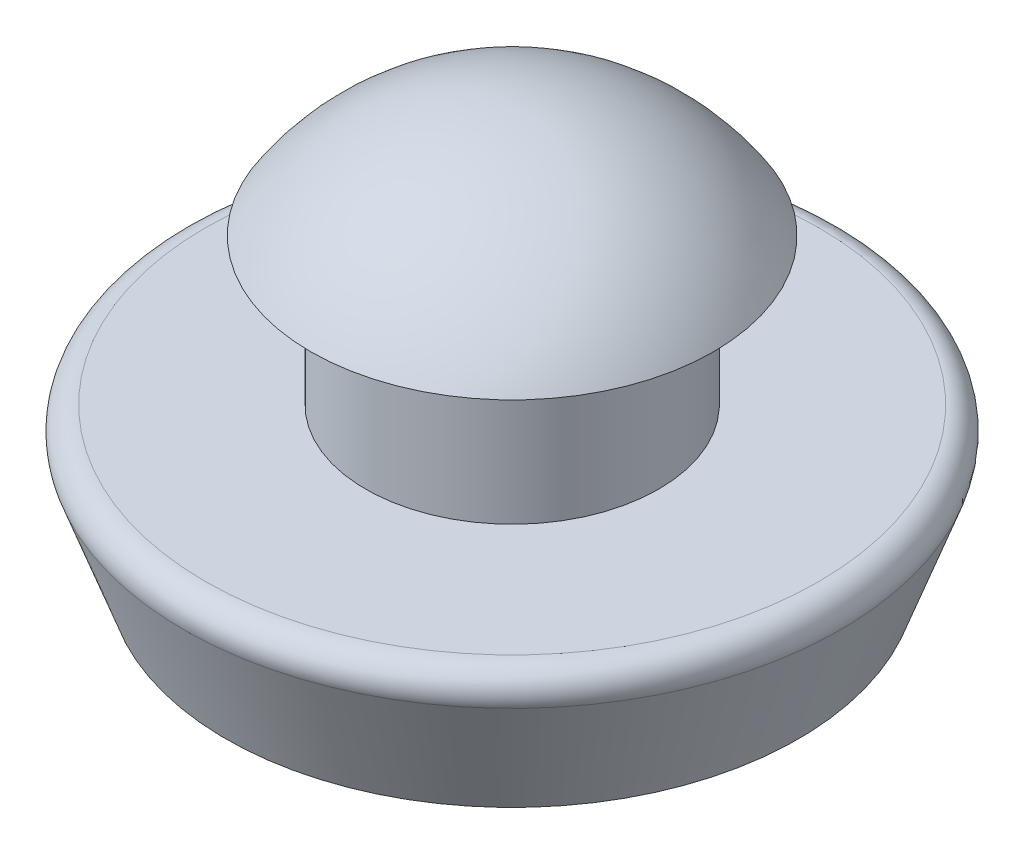
ISO-10303-21;
HEADER;
FILE_DESCRIPTION(('STEP AP214'),'2;1');
FILE_NAME('part.step','',(''),(''),'','','');
FILE_SCHEMA(('AUTOMOTIVE_DESIGN { 1 0 10303 214 1 1 1 1 }'));
ENDSEC;
DATA;
#1=APPLICATION_CONTEXT('core data for automotive mechanical design processes');
#2=APPLICATION_PROTOCOL_DEFINITION('international standard','automotive_design',2000,#1);
#3=PRODUCT_CONTEXT('',#1,'mechanical');
#4=PRODUCT('Part','Part','',(#3));
#5=PRODUCT_RELATED_PRODUCT_CATEGORY('part','',(#4));
#6=PRODUCT_DEFINITION_FORMATION('','',#4);
#7=PRODUCT_DEFINITION_CONTEXT('part definition',#1,'design');
#8=PRODUCT_DEFINITION('design','',#6,#7);
#9=PRODUCT_DEFINITION_SHAPE('','',#8);
#10=(LENGTH_UNIT() NAMED_UNIT(*) SI_UNIT(.MILLI.,.METRE.));
#11=(NAMED_UNIT(*) PLANE_ANGLE_UNIT() SI_UNIT($,.RADIAN.));
#12=(NAMED_UNIT(*) SI_UNIT($,.STERADIAN.) SOLID_ANGLE_UNIT());
#13=UNCERTAINTY_MEASURE_WITH_UNIT(LENGTH_MEASURE(1.E-05),#10,'distance_accuracy_value','');
#14=(GEOMETRIC_REPRESENTATION_CONTEXT(3) GLOBAL_UNCERTAINTY_ASSIGNED_CONTEXT((#13)) GLOBAL_UNIT_ASSIGNED_CONTEXT((#10,
#11,#12)) REPRESENTATION_CONTEXT('',''));
#15=CARTESIAN_POINT('',(0.,0.,0.));
#16=DIRECTION('',(0.,0.,1.));
#17=DIRECTION('',(1.,0.,0.));
#18=AXIS2_PLACEMENT_3D('',#15,#16,#17);
#19=CARTESIAN_POINT('',(0.,0.363802083333331,0.));
#20=DIRECTION('',(0.,1.,0.));
#21=DIRECTION('',(-1.,0.,0.));
#22=AXIS2_PLACEMENT_3D('',#19,#20,#21);
#23=SPHERICAL_SURFACE('',#22,5.19244791666667);
#24=CARTESIAN_POINT('',(0.,3.175,0.));
#25=DIRECTION('',(0.,1.,0.));
#26=DIRECTION('',(-1.,0.,0.));
#27=AXIS2_PLACEMENT_3D('',#24,#25,#26);
#28=CIRCLE('',#27,4.365625);
#29=CARTESIAN_POINT('',(-4.365625,3.175,0.));
#30=VERTEX_POINT('',#29);
#31=EDGE_CURVE('E54',#30,#30,#28,.T.);
#32=ORIENTED_EDGE('',*,*,#31,.T.);
#33=EDGE_LOOP('',(#32));
#34=FACE_BOUND('',#33,.T.);
#35=ADVANCED_FACE('F32',(#34),#23,.T.);
#36=CARTESIAN_POINT('',(0.,-3.175,0.));
#37=DIRECTION('',(0.,-1.,0.));
#38=DIRECTION('',(1.,0.,0.));
#39=AXIS2_PLACEMENT_3D('',#36,#37,#38);
#40=PLANE('',#39);
#41=CARTESIAN_POINT('',(0.,-3.175,0.));
#42=DIRECTION('',(0.,1.,0.));
#43=DIRECTION('',(-1.,0.,0.));
#44=AXIS2_PLACEMENT_3D('',#41,#42,#43);
#45=CIRCLE('',#44,6.20221850957588);
#46=CARTESIAN_POINT('',(-6.20221850957588,-3.175,0.));
#47=VERTEX_POINT('',#46);
#48=EDGE_CURVE('E10',#47,#47,#45,.T.);
#49=ORIENTED_EDGE('',*,*,#48,.F.);
#50=EDGE_LOOP('',(#49));
#51=FACE_BOUND('',#50,.T.);
#52=ADVANCED_FACE('F71',(#51),#40,.T.);
#53=CARTESIAN_POINT('',(0.,-0.671010071662831,0.));
#54=DIRECTION('',(0.,1.,0.));
#55=DIRECTION('',(-1.,0.,0.));
#56=AXIS2_PLACEMENT_3D('',#53,#54,#55);
#57=CONICAL_SURFACE('',#56,7.11359631039296,0.34906585039886);
#58=ORIENTED_EDGE('',*,*,#48,.T.);
#59=EDGE_LOOP('',(#58));
#60=FACE_BOUND('',#59,.T.);
#61=CARTESIAN_POINT('',(0.,-0.671010071662831,0.));
#62=DIRECTION('',(0.,1.,0.));
#63=DIRECTION('',(-1.,0.,0.));
#64=AXIS2_PLACEMENT_3D('',#61,#62,#63);
#65=CIRCLE('',#64,7.11359631039296);
#66=CARTESIAN_POINT('',(-7.11359631039296,-0.671010071662831,0.));
#67=VERTEX_POINT('',#66);
#68=EDGE_CURVE('E38',#67,#67,#65,.T.);
#69=ORIENTED_EDGE('',*,*,#68,.F.);
#70=EDGE_LOOP('',(#69));
#71=FACE_BOUND('',#70,.T.);
#72=ADVANCED_FACE('F75',(#60,#71),#57,.T.);
#73=CARTESIAN_POINT('',(0.,-0.499999999999999,0.));
#74=DIRECTION('',(0.,1.,0.));
#75=DIRECTION('',(-1.,0.,0.));
#76=AXIS2_PLACEMENT_3D('',#73,#74,#75);
#77=TOROIDAL_SURFACE('',#76,6.64375,0.5);
#78=ORIENTED_EDGE('',*,*,#68,.T.);
#79=EDGE_LOOP('',(#78));
#80=FACE_BOUND('',#79,.T.);
#81=CARTESIAN_POINT('',(0.,0.,0.));
#82=DIRECTION('',(0.,1.,0.));
#83=DIRECTION('',(-1.,0.,0.));
#84=AXIS2_PLACEMENT_3D('',#81,#82,#83);
#85=CIRCLE('',#84,6.64375);
#86=CARTESIAN_POINT('',(-6.64375,0.,0.));
#87=VERTEX_POINT('',#86);
#88=EDGE_CURVE('E42',#87,#87,#85,.T.);
#89=ORIENTED_EDGE('',*,*,#88,.F.);
#90=EDGE_LOOP('',(#89));
#91=FACE_BOUND('',#90,.T.);
#92=ADVANCED_FACE('F80',(#80,#91),#77,.T.);
#93=CARTESIAN_POINT('',(-6.64375,0.,0.));
#94=DIRECTION('',(0.,1.,0.));
#95=DIRECTION('',(-1.,0.,0.));
#96=AXIS2_PLACEMENT_3D('',#93,#94,#95);
#97=PLANE('',#96);
#98=ORIENTED_EDGE('',*,*,#88,.T.);
#99=EDGE_LOOP('',(#98));
#100=FACE_BOUND('',#99,.T.);
#101=CARTESIAN_POINT('',(0.,0.,0.));
#102=DIRECTION('',(0.,1.,0.));
#103=DIRECTION('',(-1.,0.,0.));
#104=AXIS2_PLACEMENT_3D('',#101,#102,#103);
#105=CIRCLE('',#104,3.175);
#106=CARTESIAN_POINT('',(-3.175,0.,0.));
#107=VERTEX_POINT('',#106);
#108=EDGE_CURVE('E46',#107,#107,#105,.T.);
#109=ORIENTED_EDGE('',*,*,#108,.F.);
#110=EDGE_LOOP('',(#109));
#111=FACE_BOUND('',#110,.T.);
#112=ADVANCED_FACE('F67',(#100,#111),#97,.T.);
#113=CARTESIAN_POINT('',(0.,5.55625,0.));
#114=DIRECTION('',(0.,1.,0.));
#115=DIRECTION('',(-1.,0.,0.));
#116=AXIS2_PLACEMENT_3D('',#113,#114,#115);
#117=CYLINDRICAL_SURFACE('',#116,3.175);
#118=ORIENTED_EDGE('',*,*,#108,.T.);
#119=EDGE_LOOP('',(#118));
#120=FACE_BOUND('',#119,.T.);
#121=CARTESIAN_POINT('',(0.,3.175,0.));
#122=DIRECTION('',(0.,1.,0.));
#123=DIRECTION('',(-1.,0.,0.));
#124=AXIS2_PLACEMENT_3D('',#121,#122,#123);
#125=CIRCLE('',#124,3.175);
#126=CARTESIAN_POINT('',(-3.175,3.175,0.));
#127=VERTEX_POINT('',#126);
#128=EDGE_CURVE('E51',#127,#127,#125,.T.);
#129=ORIENTED_EDGE('',*,*,#128,.F.);
#130=EDGE_LOOP('',(#129));
#131=FACE_BOUND('',#130,.T.);
#132=ADVANCED_FACE('F61',(#120,#131),#117,.T.);
#133=CARTESIAN_POINT('',(-3.175,3.175,0.));
#134=DIRECTION('',(0.,-1.,0.));
#135=DIRECTION('',(1.,0.,0.));
#136=AXIS2_PLACEMENT_3D('',#133,#134,#135);
#137=PLANE('',#136);
#138=ORIENTED_EDGE('',*,*,#128,.T.);
#139=EDGE_LOOP('',(#138));
#140=FACE_BOUND('',#139,.T.);
#141=ORIENTED_EDGE('',*,*,#31,.F.);
#142=EDGE_LOOP('',(#141));
#143=FACE_BOUND('',#142,.T.);
#144=ADVANCED_FACE('F59',(#140,#143),#137,.T.);
#145=CLOSED_SHELL('',(#35,#52,#72,#92,#112,#132,#144));
#146=MANIFOLD_SOLID_BREP('B2',#145);
#147=ADVANCED_BREP_SHAPE_REPRESENTATION('',(#18,#146),#14);
#148=SHAPE_DEFINITION_REPRESENTATION(#9,#147);
ENDSEC;
END-ISO-10303-21;
